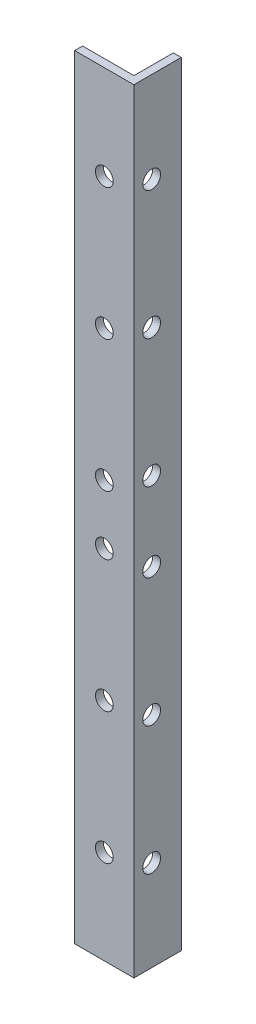
ISO-10303-21;
HEADER;
FILE_DESCRIPTION(('STEP AP214'),'2;1');
FILE_NAME('part.step','',(''),(''),'','','');
FILE_SCHEMA(('AUTOMOTIVE_DESIGN { 1 0 10303 214 1 1 1 1 }'));
ENDSEC;
DATA;
#1=APPLICATION_CONTEXT('core data for automotive mechanical design processes');
#2=APPLICATION_PROTOCOL_DEFINITION('international standard','automotive_design',2000,#1);
#3=PRODUCT_CONTEXT('',#1,'mechanical');
#4=PRODUCT('Part','Part','',(#3));
#5=PRODUCT_RELATED_PRODUCT_CATEGORY('part','',(#4));
#6=PRODUCT_DEFINITION_FORMATION('','',#4);
#7=PRODUCT_DEFINITION_CONTEXT('part definition',#1,'design');
#8=PRODUCT_DEFINITION('design','',#6,#7);
#9=PRODUCT_DEFINITION_SHAPE('','',#8);
#10=(LENGTH_UNIT() NAMED_UNIT(*) SI_UNIT(.MILLI.,.METRE.));
#11=(NAMED_UNIT(*) PLANE_ANGLE_UNIT() SI_UNIT($,.RADIAN.));
#12=(NAMED_UNIT(*) SI_UNIT($,.STERADIAN.) SOLID_ANGLE_UNIT());
#13=UNCERTAINTY_MEASURE_WITH_UNIT(LENGTH_MEASURE(1.E-05),#10,'distance_accuracy_value','');
#14=(GEOMETRIC_REPRESENTATION_CONTEXT(3) GLOBAL_UNCERTAINTY_ASSIGNED_CONTEXT((#13)) GLOBAL_UNIT_ASSIGNED_CONTEXT((#10,
#11,#12)) REPRESENTATION_CONTEXT('',''));
#15=CARTESIAN_POINT('',(0.,0.,0.));
#16=DIRECTION('',(0.,0.,1.));
#17=DIRECTION('',(1.,0.,0.));
#18=AXIS2_PLACEMENT_3D('',#15,#16,#17);
#19=CARTESIAN_POINT('',(0.,196.,-2.));
#20=DIRECTION('',(1.,0.,0.));
#21=DIRECTION('',(0.,0.,-1.));
#22=AXIS2_PLACEMENT_3D('',#19,#20,#21);
#23=PLANE('',#22);
#24=DIRECTION('',(0.,0.,1.));
#25=VECTOR('',#24,1.);
#26=CARTESIAN_POINT('',(0.,0.,-2.));
#27=LINE('',#26,#25);
#28=CARTESIAN_POINT('',(0.,0.,-2.));
#29=VERTEX_POINT('',#28);
#30=CARTESIAN_POINT('',(0.,0.,0.));
#31=VERTEX_POINT('',#30);
#32=EDGE_CURVE('E123',#29,#31,#27,.T.);
#33=ORIENTED_EDGE('',*,*,#32,.T.);
#34=DIRECTION('',(0.,-1.,0.));
#35=VECTOR('',#34,1.);
#36=CARTESIAN_POINT('',(0.,196.,0.));
#37=LINE('',#36,#35);
#38=CARTESIAN_POINT('',(0.,196.,0.));
#39=VERTEX_POINT('',#38);
#40=EDGE_CURVE('E11',#39,#31,#37,.T.);
#41=ORIENTED_EDGE('',*,*,#40,.F.);
#42=DIRECTION('',(0.,0.,1.));
#43=VECTOR('',#42,1.);
#44=CARTESIAN_POINT('',(0.,196.,-2.));
#45=LINE('',#44,#43);
#46=CARTESIAN_POINT('',(0.,196.,-2.));
#47=VERTEX_POINT('',#46);
#48=EDGE_CURVE('E134',#47,#39,#45,.T.);
#49=ORIENTED_EDGE('',*,*,#48,.F.);
#50=DIRECTION('',(0.,-1.,0.));
#51=VECTOR('',#50,1.);
#52=CARTESIAN_POINT('',(0.,196.,-2.));
#53=LINE('',#52,#51);
#54=EDGE_CURVE('E119',#47,#29,#53,.T.);
#55=ORIENTED_EDGE('',*,*,#54,.T.);
#56=EDGE_LOOP('',(#33,#41,#49,#55));
#57=FACE_BOUND('',#56,.T.);
#58=ADVANCED_FACE('F39',(#57),#23,.F.);
#59=CARTESIAN_POINT('',(0.,196.,0.));
#60=DIRECTION('',(0.,0.,-1.));
#61=DIRECTION('',(-1.,0.,0.));
#62=AXIS2_PLACEMENT_3D('',#59,#60,#61);
#63=PLANE('',#62);
#64=CARTESIAN_POINT('',(7.49999999999998,23.8333333333333,0.));
#65=DIRECTION('',(0.,0.,1.));
#66=DIRECTION('',(1.,0.,0.));
#67=AXIS2_PLACEMENT_3D('',#64,#65,#66);
#68=CIRCLE('',#67,2.24999999999999);
#69=CARTESIAN_POINT('',(9.74999999999997,23.8333333333333,0.));
#70=VERTEX_POINT('',#69);
#71=EDGE_CURVE('E421',#70,#70,#68,.T.);
#72=ORIENTED_EDGE('',*,*,#71,.F.);
#73=EDGE_LOOP('',(#72));
#74=FACE_BOUND('',#73,.T.);
#75=CARTESIAN_POINT('',(7.49999999999997,57.1666666666667,0.));
#76=DIRECTION('',(0.,0.,1.));
#77=DIRECTION('',(1.,0.,0.));
#78=AXIS2_PLACEMENT_3D('',#75,#76,#77);
#79=CIRCLE('',#78,2.24999999999999);
#80=CARTESIAN_POINT('',(9.74999999999996,57.1666666666667,0.));
#81=VERTEX_POINT('',#80);
#82=EDGE_CURVE('E429',#81,#81,#79,.T.);
#83=ORIENTED_EDGE('',*,*,#82,.F.);
#84=EDGE_LOOP('',(#83));
#85=FACE_BOUND('',#84,.T.);
#86=CARTESIAN_POINT('',(7.49999999999997,90.5,0.));
#87=DIRECTION('',(0.,0.,1.));
#88=DIRECTION('',(1.,0.,0.));
#89=AXIS2_PLACEMENT_3D('',#86,#87,#88);
#90=CIRCLE('',#89,2.25);
#91=CARTESIAN_POINT('',(9.74999999999997,90.5,0.));
#92=VERTEX_POINT('',#91);
#93=EDGE_CURVE('E435',#92,#92,#90,.T.);
#94=ORIENTED_EDGE('',*,*,#93,.F.);
#95=EDGE_LOOP('',(#94));
#96=FACE_BOUND('',#95,.T.);
#97=CARTESIAN_POINT('',(7.49999999999997,105.5,0.));
#98=DIRECTION('',(0.,0.,1.));
#99=DIRECTION('',(1.,0.,0.));
#100=AXIS2_PLACEMENT_3D('',#97,#98,#99);
#101=CIRCLE('',#100,2.25);
#102=CARTESIAN_POINT('',(9.74999999999997,105.5,0.));
#103=VERTEX_POINT('',#102);
#104=EDGE_CURVE('E441',#103,#103,#101,.T.);
#105=ORIENTED_EDGE('',*,*,#104,.F.);
#106=EDGE_LOOP('',(#105));
#107=FACE_BOUND('',#106,.T.);
#108=CARTESIAN_POINT('',(7.49999999999997,138.833333333333,0.));
#109=DIRECTION('',(0.,0.,1.));
#110=DIRECTION('',(1.,0.,0.));
#111=AXIS2_PLACEMENT_3D('',#108,#109,#110);
#112=CIRCLE('',#111,2.25);
#113=CARTESIAN_POINT('',(9.74999999999997,138.833333333333,0.));
#114=VERTEX_POINT('',#113);
#115=EDGE_CURVE('E447',#114,#114,#112,.T.);
#116=ORIENTED_EDGE('',*,*,#115,.F.);
#117=EDGE_LOOP('',(#116));
#118=FACE_BOUND('',#117,.T.);
#119=CARTESIAN_POINT('',(7.49999999999998,172.166666666667,0.));
#120=DIRECTION('',(0.,0.,1.));
#121=DIRECTION('',(1.,0.,0.));
#122=AXIS2_PLACEMENT_3D('',#119,#120,#121);
#123=CIRCLE('',#122,2.25);
#124=CARTESIAN_POINT('',(9.74999999999998,172.166666666667,0.));
#125=VERTEX_POINT('',#124);
#126=EDGE_CURVE('E453',#125,#125,#123,.T.);
#127=ORIENTED_EDGE('',*,*,#126,.F.);
#128=EDGE_LOOP('',(#127));
#129=FACE_BOUND('',#128,.T.);
#130=DIRECTION('',(1.,0.,0.));
#131=VECTOR('',#130,1.);
#132=CARTESIAN_POINT('',(0.,0.,0.));
#133=LINE('',#132,#131);
#134=CARTESIAN_POINT('',(15.,0.,0.));
#135=VERTEX_POINT('',#134);
#136=EDGE_CURVE('E126',#31,#135,#133,.T.);
#137=ORIENTED_EDGE('',*,*,#136,.T.);
#138=DIRECTION('',(0.,-1.,0.));
#139=VECTOR('',#138,1.);
#140=CARTESIAN_POINT('',(15.,196.,0.));
#141=LINE('',#140,#139);
#142=CARTESIAN_POINT('',(15.,196.,0.));
#143=VERTEX_POINT('',#142);
#144=EDGE_CURVE('E47',#143,#135,#141,.T.);
#145=ORIENTED_EDGE('',*,*,#144,.F.);
#146=DIRECTION('',(1.,0.,0.));
#147=VECTOR('',#146,1.);
#148=CARTESIAN_POINT('',(0.,196.,0.));
#149=LINE('',#148,#147);
#150=EDGE_CURVE('E92',#39,#143,#149,.T.);
#151=ORIENTED_EDGE('',*,*,#150,.F.);
#152=ORIENTED_EDGE('',*,*,#40,.T.);
#153=EDGE_LOOP('',(#137,#145,#151,#152));
#154=FACE_BOUND('',#153,.T.);
#155=ADVANCED_FACE('F162',(#74,#85,#96,#107,#118,#129,#154),#63,.F.);
#156=CARTESIAN_POINT('',(15.,196.,0.));
#157=DIRECTION('',(-1.,0.,0.));
#158=DIRECTION('',(0.,0.,1.));
#159=AXIS2_PLACEMENT_3D('',#156,#157,#158);
#160=PLANE('',#159);
#161=CARTESIAN_POINT('',(15.,23.,-4.49999999999989));
#162=DIRECTION('',(1.,0.,0.));
#163=DIRECTION('',(0.,0.,-1.));
#164=AXIS2_PLACEMENT_3D('',#161,#162,#163);
#165=CIRCLE('',#164,2.25);
#166=CARTESIAN_POINT('',(15.,23.,-6.74999999999989));
#167=VERTEX_POINT('',#166);
#168=EDGE_CURVE('E461',#167,#167,#165,.T.);
#169=ORIENTED_EDGE('',*,*,#168,.F.);
#170=EDGE_LOOP('',(#169));
#171=FACE_BOUND('',#170,.T.);
#172=CARTESIAN_POINT('',(15.,55.5,-4.49999999999992));
#173=DIRECTION('',(1.,0.,0.));
#174=DIRECTION('',(0.,0.,-1.));
#175=AXIS2_PLACEMENT_3D('',#172,#173,#174);
#176=CIRCLE('',#175,2.25);
#177=CARTESIAN_POINT('',(15.,55.5,-6.74999999999992));
#178=VERTEX_POINT('',#177);
#179=EDGE_CURVE('E464',#178,#178,#176,.T.);
#180=ORIENTED_EDGE('',*,*,#179,.F.);
#181=EDGE_LOOP('',(#180));
#182=FACE_BOUND('',#181,.T.);
#183=CARTESIAN_POINT('',(15.,88.0000000000001,-4.50000000000003));
#184=DIRECTION('',(1.,0.,0.));
#185=DIRECTION('',(0.,0.,-1.));
#186=AXIS2_PLACEMENT_3D('',#183,#184,#185);
#187=CIRCLE('',#186,2.25);
#188=CARTESIAN_POINT('',(15.,88.0000000000001,-6.75000000000003));
#189=VERTEX_POINT('',#188);
#190=EDGE_CURVE('E470',#189,#189,#187,.T.);
#191=ORIENTED_EDGE('',*,*,#190,.F.);
#192=EDGE_LOOP('',(#191));
#193=FACE_BOUND('',#192,.T.);
#194=CARTESIAN_POINT('',(15.,108.,-4.50000000000003));
#195=DIRECTION('',(1.,0.,0.));
#196=DIRECTION('',(0.,0.,-1.));
#197=AXIS2_PLACEMENT_3D('',#194,#195,#196);
#198=CIRCLE('',#197,2.25);
#199=CARTESIAN_POINT('',(15.,108.,-6.75000000000003));
#200=VERTEX_POINT('',#199);
#201=EDGE_CURVE('E476',#200,#200,#198,.T.);
#202=ORIENTED_EDGE('',*,*,#201,.F.);
#203=EDGE_LOOP('',(#202));
#204=FACE_BOUND('',#203,.T.);
#205=CARTESIAN_POINT('',(15.,140.5,-4.49999999999992));
#206=DIRECTION('',(1.,0.,0.));
#207=DIRECTION('',(0.,0.,-1.));
#208=AXIS2_PLACEMENT_3D('',#205,#206,#207);
#209=CIRCLE('',#208,2.25);
#210=CARTESIAN_POINT('',(15.,140.5,-6.74999999999992));
#211=VERTEX_POINT('',#210);
#212=EDGE_CURVE('E482',#211,#211,#209,.T.);
#213=ORIENTED_EDGE('',*,*,#212,.F.);
#214=EDGE_LOOP('',(#213));
#215=FACE_BOUND('',#214,.T.);
#216=CARTESIAN_POINT('',(15.,173.,-4.49999999999995));
#217=DIRECTION('',(1.,0.,0.));
#218=DIRECTION('',(0.,0.,-1.));
#219=AXIS2_PLACEMENT_3D('',#216,#217,#218);
#220=CIRCLE('',#219,2.25);
#221=CARTESIAN_POINT('',(15.,173.,-6.74999999999995));
#222=VERTEX_POINT('',#221);
#223=EDGE_CURVE('E427',#222,#222,#220,.T.);
#224=ORIENTED_EDGE('',*,*,#223,.F.);
#225=EDGE_LOOP('',(#224));
#226=FACE_BOUND('',#225,.T.);
#227=DIRECTION('',(0.,0.,-1.));
#228=VECTOR('',#227,1.);
#229=CARTESIAN_POINT('',(15.,0.,0.));
#230=LINE('',#229,#228);
#231=CARTESIAN_POINT('',(15.,0.,-12.));
#232=VERTEX_POINT('',#231);
#233=EDGE_CURVE('E129',#135,#232,#230,.T.);
#234=ORIENTED_EDGE('',*,*,#233,.T.);
#235=DIRECTION('',(0.,-1.,0.));
#236=VECTOR('',#235,1.);
#237=CARTESIAN_POINT('',(15.,196.,-12.));
#238=LINE('',#237,#236);
#239=CARTESIAN_POINT('',(15.,196.,-12.));
#240=VERTEX_POINT('',#239);
#241=EDGE_CURVE('E114',#240,#232,#238,.T.);
#242=ORIENTED_EDGE('',*,*,#241,.F.);
#243=DIRECTION('',(0.,0.,-1.));
#244=VECTOR('',#243,1.);
#245=CARTESIAN_POINT('',(15.,196.,0.));
#246=LINE('',#245,#244);
#247=EDGE_CURVE('E105',#143,#240,#246,.T.);
#248=ORIENTED_EDGE('',*,*,#247,.F.);
#249=ORIENTED_EDGE('',*,*,#144,.T.);
#250=EDGE_LOOP('',(#234,#242,#248,#249));
#251=FACE_BOUND('',#250,.T.);
#252=ADVANCED_FACE('F140',(#171,#182,#193,#204,#215,#226,#251),#160,.F.);
#253=CARTESIAN_POINT('',(15.,196.,-12.));
#254=DIRECTION('',(0.,0.,1.));
#255=DIRECTION('',(1.,0.,0.));
#256=AXIS2_PLACEMENT_3D('',#253,#254,#255);
#257=PLANE('',#256);
#258=DIRECTION('',(-1.,0.,0.));
#259=VECTOR('',#258,1.);
#260=CARTESIAN_POINT('',(15.,0.,-12.));
#261=LINE('',#260,#259);
#262=CARTESIAN_POINT('',(13.,0.,-12.));
#263=VERTEX_POINT('',#262);
#264=EDGE_CURVE('E113',#232,#263,#261,.T.);
#265=ORIENTED_EDGE('',*,*,#264,.T.);
#266=DIRECTION('',(0.,-1.,0.));
#267=VECTOR('',#266,1.);
#268=CARTESIAN_POINT('',(13.,196.,-12.));
#269=LINE('',#268,#267);
#270=CARTESIAN_POINT('',(13.,196.,-12.));
#271=VERTEX_POINT('',#270);
#272=EDGE_CURVE('E110',#271,#263,#269,.T.);
#273=ORIENTED_EDGE('',*,*,#272,.F.);
#274=DIRECTION('',(-1.,0.,0.));
#275=VECTOR('',#274,1.);
#276=CARTESIAN_POINT('',(15.,196.,-12.));
#277=LINE('',#276,#275);
#278=EDGE_CURVE('E99',#240,#271,#277,.T.);
#279=ORIENTED_EDGE('',*,*,#278,.F.);
#280=ORIENTED_EDGE('',*,*,#241,.T.);
#281=EDGE_LOOP('',(#265,#273,#279,#280));
#282=FACE_BOUND('',#281,.T.);
#283=ADVANCED_FACE('F111',(#282),#257,.F.);
#284=CARTESIAN_POINT('',(13.,196.,-12.));
#285=DIRECTION('',(1.,0.,0.));
#286=DIRECTION('',(0.,0.,-1.));
#287=AXIS2_PLACEMENT_3D('',#284,#285,#286);
#288=PLANE('',#287);
#289=CARTESIAN_POINT('',(13.,23.,-4.49999999999989));
#290=DIRECTION('',(1.,0.,0.));
#291=DIRECTION('',(0.,0.,-1.));
#292=AXIS2_PLACEMENT_3D('',#289,#290,#291);
#293=CIRCLE('',#292,2.25);
#294=CARTESIAN_POINT('',(13.,23.,-6.7499999999999));
#295=VERTEX_POINT('',#294);
#296=EDGE_CURVE('E127',#295,#295,#293,.F.);
#297=ORIENTED_EDGE('',*,*,#296,.F.);
#298=EDGE_LOOP('',(#297));
#299=FACE_BOUND('',#298,.T.);
#300=CARTESIAN_POINT('',(13.,55.5,-4.49999999999992));
#301=DIRECTION('',(1.,0.,0.));
#302=DIRECTION('',(0.,0.,-1.));
#303=AXIS2_PLACEMENT_3D('',#300,#301,#302);
#304=CIRCLE('',#303,2.25);
#305=CARTESIAN_POINT('',(13.,55.5,-6.74999999999992));
#306=VERTEX_POINT('',#305);
#307=EDGE_CURVE('E467',#306,#306,#304,.F.);
#308=ORIENTED_EDGE('',*,*,#307,.F.);
#309=EDGE_LOOP('',(#308));
#310=FACE_BOUND('',#309,.T.);
#311=CARTESIAN_POINT('',(13.,88.0000000000001,-4.50000000000003));
#312=DIRECTION('',(1.,0.,0.));
#313=DIRECTION('',(0.,0.,-1.));
#314=AXIS2_PLACEMENT_3D('',#311,#312,#313);
#315=CIRCLE('',#314,2.25);
#316=CARTESIAN_POINT('',(13.,88.0000000000001,-6.75000000000003));
#317=VERTEX_POINT('',#316);
#318=EDGE_CURVE('E473',#317,#317,#315,.F.);
#319=ORIENTED_EDGE('',*,*,#318,.F.);
#320=EDGE_LOOP('',(#319));
#321=FACE_BOUND('',#320,.T.);
#322=CARTESIAN_POINT('',(13.,108.,-4.50000000000003));
#323=DIRECTION('',(1.,0.,0.));
#324=DIRECTION('',(0.,0.,-1.));
#325=AXIS2_PLACEMENT_3D('',#322,#323,#324);
#326=CIRCLE('',#325,2.25);
#327=CARTESIAN_POINT('',(13.,108.,-6.75000000000004));
#328=VERTEX_POINT('',#327);
#329=EDGE_CURVE('E479',#328,#328,#326,.F.);
#330=ORIENTED_EDGE('',*,*,#329,.F.);
#331=EDGE_LOOP('',(#330));
#332=FACE_BOUND('',#331,.T.);
#333=CARTESIAN_POINT('',(13.,140.5,-4.49999999999992));
#334=DIRECTION('',(1.,0.,0.));
#335=DIRECTION('',(0.,0.,-1.));
#336=AXIS2_PLACEMENT_3D('',#333,#334,#335);
#337=CIRCLE('',#336,2.25);
#338=CARTESIAN_POINT('',(13.,140.5,-6.74999999999992));
#339=VERTEX_POINT('',#338);
#340=EDGE_CURVE('E485',#339,#339,#337,.F.);
#341=ORIENTED_EDGE('',*,*,#340,.F.);
#342=EDGE_LOOP('',(#341));
#343=FACE_BOUND('',#342,.T.);
#344=CARTESIAN_POINT('',(13.,173.,-4.49999999999995));
#345=DIRECTION('',(1.,0.,0.));
#346=DIRECTION('',(0.,0.,-1.));
#347=AXIS2_PLACEMENT_3D('',#344,#345,#346);
#348=CIRCLE('',#347,2.25);
#349=CARTESIAN_POINT('',(13.,173.,-6.74999999999995));
#350=VERTEX_POINT('',#349);
#351=EDGE_CURVE('E424',#350,#350,#348,.F.);
#352=ORIENTED_EDGE('',*,*,#351,.F.);
#353=EDGE_LOOP('',(#352));
#354=FACE_BOUND('',#353,.T.);
#355=DIRECTION('',(0.,0.,1.));
#356=VECTOR('',#355,1.);
#357=CARTESIAN_POINT('',(13.,0.,-12.));
#358=LINE('',#357,#356);
#359=CARTESIAN_POINT('',(13.,0.,-2.));
#360=VERTEX_POINT('',#359);
#361=EDGE_CURVE('E78',#263,#360,#358,.T.);
#362=ORIENTED_EDGE('',*,*,#361,.T.);
#363=DIRECTION('',(0.,-1.,0.));
#364=VECTOR('',#363,1.);
#365=CARTESIAN_POINT('',(13.,196.,-2.));
#366=LINE('',#365,#364);
#367=CARTESIAN_POINT('',(13.,196.,-2.));
#368=VERTEX_POINT('',#367);
#369=EDGE_CURVE('E115',#368,#360,#366,.T.);
#370=ORIENTED_EDGE('',*,*,#369,.F.);
#371=DIRECTION('',(0.,0.,1.));
#372=VECTOR('',#371,1.);
#373=CARTESIAN_POINT('',(13.,196.,-12.));
#374=LINE('',#373,#372);
#375=EDGE_CURVE('E103',#271,#368,#374,.T.);
#376=ORIENTED_EDGE('',*,*,#375,.F.);
#377=ORIENTED_EDGE('',*,*,#272,.T.);
#378=EDGE_LOOP('',(#362,#370,#376,#377));
#379=FACE_BOUND('',#378,.T.);
#380=ADVANCED_FACE('F117',(#299,#310,#321,#332,#343,#354,#379),#288,.F.);
#381=CARTESIAN_POINT('',(13.,196.,-2.));
#382=DIRECTION('',(0.,0.,1.));
#383=DIRECTION('',(1.,0.,0.));
#384=AXIS2_PLACEMENT_3D('',#381,#382,#383);
#385=PLANE('',#384);
#386=CARTESIAN_POINT('',(7.49999999999998,23.8333333333333,-2.));
#387=DIRECTION('',(0.,0.,1.));
#388=DIRECTION('',(1.,0.,0.));
#389=AXIS2_PLACEMENT_3D('',#386,#387,#388);
#390=CIRCLE('',#389,2.24999999999999);
#391=CARTESIAN_POINT('',(9.74999999999997,23.8333333333333,-2.));
#392=VERTEX_POINT('',#391);
#393=EDGE_CURVE('E423',#392,#392,#390,.F.);
#394=ORIENTED_EDGE('',*,*,#393,.F.);
#395=EDGE_LOOP('',(#394));
#396=FACE_BOUND('',#395,.T.);
#397=CARTESIAN_POINT('',(7.49999999999997,57.1666666666667,-2.));
#398=DIRECTION('',(0.,0.,1.));
#399=DIRECTION('',(1.,0.,0.));
#400=AXIS2_PLACEMENT_3D('',#397,#398,#399);
#401=CIRCLE('',#400,2.24999999999999);
#402=CARTESIAN_POINT('',(9.74999999999996,57.1666666666667,-2.));
#403=VERTEX_POINT('',#402);
#404=EDGE_CURVE('E432',#403,#403,#401,.F.);
#405=ORIENTED_EDGE('',*,*,#404,.F.);
#406=EDGE_LOOP('',(#405));
#407=FACE_BOUND('',#406,.T.);
#408=CARTESIAN_POINT('',(7.49999999999997,90.5,-2.));
#409=DIRECTION('',(0.,0.,1.));
#410=DIRECTION('',(1.,0.,0.));
#411=AXIS2_PLACEMENT_3D('',#408,#409,#410);
#412=CIRCLE('',#411,2.25);
#413=CARTESIAN_POINT('',(9.74999999999997,90.5,-2.));
#414=VERTEX_POINT('',#413);
#415=EDGE_CURVE('E438',#414,#414,#412,.F.);
#416=ORIENTED_EDGE('',*,*,#415,.F.);
#417=EDGE_LOOP('',(#416));
#418=FACE_BOUND('',#417,.T.);
#419=CARTESIAN_POINT('',(7.49999999999997,105.5,-2.));
#420=DIRECTION('',(0.,0.,1.));
#421=DIRECTION('',(1.,0.,0.));
#422=AXIS2_PLACEMENT_3D('',#419,#420,#421);
#423=CIRCLE('',#422,2.25);
#424=CARTESIAN_POINT('',(9.74999999999997,105.5,-2.));
#425=VERTEX_POINT('',#424);
#426=EDGE_CURVE('E444',#425,#425,#423,.F.);
#427=ORIENTED_EDGE('',*,*,#426,.F.);
#428=EDGE_LOOP('',(#427));
#429=FACE_BOUND('',#428,.T.);
#430=CARTESIAN_POINT('',(7.49999999999997,138.833333333333,-2.));
#431=DIRECTION('',(0.,0.,1.));
#432=DIRECTION('',(1.,0.,0.));
#433=AXIS2_PLACEMENT_3D('',#430,#431,#432);
#434=CIRCLE('',#433,2.25);
#435=CARTESIAN_POINT('',(9.74999999999997,138.833333333333,-2.));
#436=VERTEX_POINT('',#435);
#437=EDGE_CURVE('E450',#436,#436,#434,.F.);
#438=ORIENTED_EDGE('',*,*,#437,.F.);
#439=EDGE_LOOP('',(#438));
#440=FACE_BOUND('',#439,.T.);
#441=CARTESIAN_POINT('',(7.49999999999998,172.166666666667,-2.));
#442=DIRECTION('',(0.,0.,1.));
#443=DIRECTION('',(1.,0.,0.));
#444=AXIS2_PLACEMENT_3D('',#441,#442,#443);
#445=CIRCLE('',#444,2.25);
#446=CARTESIAN_POINT('',(9.74999999999998,172.166666666667,-2.));
#447=VERTEX_POINT('',#446);
#448=EDGE_CURVE('E456',#447,#447,#445,.F.);
#449=ORIENTED_EDGE('',*,*,#448,.F.);
#450=EDGE_LOOP('',(#449));
#451=FACE_BOUND('',#450,.T.);
#452=DIRECTION('',(-1.,0.,0.));
#453=VECTOR('',#452,1.);
#454=CARTESIAN_POINT('',(13.,0.,-2.));
#455=LINE('',#454,#453);
#456=EDGE_CURVE('E84',#360,#29,#455,.T.);
#457=ORIENTED_EDGE('',*,*,#456,.T.);
#458=ORIENTED_EDGE('',*,*,#54,.F.);
#459=DIRECTION('',(-1.,0.,0.));
#460=VECTOR('',#459,1.);
#461=CARTESIAN_POINT('',(13.,196.,-2.));
#462=LINE('',#461,#460);
#463=EDGE_CURVE('E55',#368,#47,#462,.T.);
#464=ORIENTED_EDGE('',*,*,#463,.F.);
#465=ORIENTED_EDGE('',*,*,#369,.T.);
#466=EDGE_LOOP('',(#457,#458,#464,#465));
#467=FACE_BOUND('',#466,.T.);
#468=ADVANCED_FACE('F147',(#396,#407,#418,#429,#440,#451,#467),#385,.F.);
#469=CARTESIAN_POINT('',(0.,196.,0.));
#470=DIRECTION('',(0.,1.,0.));
#471=DIRECTION('',(0.,0.,1.));
#472=AXIS2_PLACEMENT_3D('',#469,#470,#471);
#473=PLANE('',#472);
#474=ORIENTED_EDGE('',*,*,#48,.T.);
#475=ORIENTED_EDGE('',*,*,#150,.T.);
#476=ORIENTED_EDGE('',*,*,#247,.T.);
#477=ORIENTED_EDGE('',*,*,#278,.T.);
#478=ORIENTED_EDGE('',*,*,#375,.T.);
#479=ORIENTED_EDGE('',*,*,#463,.T.);
#480=EDGE_LOOP('',(#474,#475,#476,#477,#478,#479));
#481=FACE_BOUND('',#480,.T.);
#482=ADVANCED_FACE('F101',(#481),#473,.T.);
#483=CARTESIAN_POINT('',(0.,0.,0.));
#484=DIRECTION('',(0.,1.,0.));
#485=DIRECTION('',(0.,0.,1.));
#486=AXIS2_PLACEMENT_3D('',#483,#484,#485);
#487=PLANE('',#486);
#488=ORIENTED_EDGE('',*,*,#32,.F.);
#489=ORIENTED_EDGE('',*,*,#456,.F.);
#490=ORIENTED_EDGE('',*,*,#361,.F.);
#491=ORIENTED_EDGE('',*,*,#264,.F.);
#492=ORIENTED_EDGE('',*,*,#233,.F.);
#493=ORIENTED_EDGE('',*,*,#136,.F.);
#494=EDGE_LOOP('',(#488,#489,#490,#491,#492,#493));
#495=FACE_BOUND('',#494,.T.);
#496=ADVANCED_FACE('F143',(#495),#487,.F.);
#497=CARTESIAN_POINT('',(-0.001000000000001,173.,-4.49999999999995));
#498=DIRECTION('',(1.,0.,0.));
#499=DIRECTION('',(0.,0.,-1.));
#500=AXIS2_PLACEMENT_3D('',#497,#498,#499);
#501=CYLINDRICAL_SURFACE('',#500,2.25);
#502=ORIENTED_EDGE('',*,*,#223,.T.);
#503=EDGE_LOOP('',(#502));
#504=FACE_BOUND('',#503,.T.);
#505=ORIENTED_EDGE('',*,*,#351,.T.);
#506=EDGE_LOOP('',(#505));
#507=FACE_BOUND('',#506,.T.);
#508=ADVANCED_FACE('F207',(#504,#507),#501,.F.);
#509=CARTESIAN_POINT('',(-0.001000000000001,140.5,-4.49999999999992));
#510=DIRECTION('',(1.,0.,0.));
#511=DIRECTION('',(0.,0.,-1.));
#512=AXIS2_PLACEMENT_3D('',#509,#510,#511);
#513=CYLINDRICAL_SURFACE('',#512,2.25);
#514=ORIENTED_EDGE('',*,*,#212,.T.);
#515=EDGE_LOOP('',(#514));
#516=FACE_BOUND('',#515,.T.);
#517=ORIENTED_EDGE('',*,*,#340,.T.);
#518=EDGE_LOOP('',(#517));
#519=FACE_BOUND('',#518,.T.);
#520=ADVANCED_FACE('F214',(#516,#519),#513,.F.);
#521=CARTESIAN_POINT('',(-0.001000000000001,108.,-4.50000000000003));
#522=DIRECTION('',(1.,0.,0.));
#523=DIRECTION('',(0.,0.,-1.));
#524=AXIS2_PLACEMENT_3D('',#521,#522,#523);
#525=CYLINDRICAL_SURFACE('',#524,2.25);
#526=ORIENTED_EDGE('',*,*,#201,.T.);
#527=EDGE_LOOP('',(#526));
#528=FACE_BOUND('',#527,.T.);
#529=ORIENTED_EDGE('',*,*,#329,.T.);
#530=EDGE_LOOP('',(#529));
#531=FACE_BOUND('',#530,.T.);
#532=ADVANCED_FACE('F224',(#528,#531),#525,.F.);
#533=CARTESIAN_POINT('',(-0.001000000000001,88.0000000000001,-4.50000000000003));
#534=DIRECTION('',(1.,0.,0.));
#535=DIRECTION('',(0.,0.,-1.));
#536=AXIS2_PLACEMENT_3D('',#533,#534,#535);
#537=CYLINDRICAL_SURFACE('',#536,2.25);
#538=ORIENTED_EDGE('',*,*,#190,.T.);
#539=EDGE_LOOP('',(#538));
#540=FACE_BOUND('',#539,.T.);
#541=ORIENTED_EDGE('',*,*,#318,.T.);
#542=EDGE_LOOP('',(#541));
#543=FACE_BOUND('',#542,.T.);
#544=ADVANCED_FACE('F234',(#540,#543),#537,.F.);
#545=CARTESIAN_POINT('',(-0.001000000000001,55.5,-4.49999999999992));
#546=DIRECTION('',(1.,0.,0.));
#547=DIRECTION('',(0.,0.,-1.));
#548=AXIS2_PLACEMENT_3D('',#545,#546,#547);
#549=CYLINDRICAL_SURFACE('',#548,2.25);
#550=ORIENTED_EDGE('',*,*,#179,.T.);
#551=EDGE_LOOP('',(#550));
#552=FACE_BOUND('',#551,.T.);
#553=ORIENTED_EDGE('',*,*,#307,.T.);
#554=EDGE_LOOP('',(#553));
#555=FACE_BOUND('',#554,.T.);
#556=ADVANCED_FACE('F244',(#552,#555),#549,.F.);
#557=CARTESIAN_POINT('',(-0.001000000000001,23.,-4.49999999999989));
#558=DIRECTION('',(1.,0.,0.));
#559=DIRECTION('',(0.,0.,-1.));
#560=AXIS2_PLACEMENT_3D('',#557,#558,#559);
#561=CYLINDRICAL_SURFACE('',#560,2.25);
#562=ORIENTED_EDGE('',*,*,#168,.T.);
#563=EDGE_LOOP('',(#562));
#564=FACE_BOUND('',#563,.T.);
#565=ORIENTED_EDGE('',*,*,#296,.T.);
#566=EDGE_LOOP('',(#565));
#567=FACE_BOUND('',#566,.T.);
#568=ADVANCED_FACE('F254',(#564,#567),#561,.F.);
#569=CARTESIAN_POINT('',(7.49999999999998,172.166666666667,-12.001));
#570=DIRECTION('',(0.,0.,1.));
#571=DIRECTION('',(1.,0.,0.));
#572=AXIS2_PLACEMENT_3D('',#569,#570,#571);
#573=CYLINDRICAL_SURFACE('',#572,2.25);
#574=ORIENTED_EDGE('',*,*,#126,.T.);
#575=EDGE_LOOP('',(#574));
#576=FACE_BOUND('',#575,.T.);
#577=ORIENTED_EDGE('',*,*,#448,.T.);
#578=EDGE_LOOP('',(#577));
#579=FACE_BOUND('',#578,.T.);
#580=ADVANCED_FACE('F264',(#576,#579),#573,.F.);
#581=CARTESIAN_POINT('',(7.49999999999997,138.833333333333,-12.001));
#582=DIRECTION('',(0.,0.,1.));
#583=DIRECTION('',(1.,0.,0.));
#584=AXIS2_PLACEMENT_3D('',#581,#582,#583);
#585=CYLINDRICAL_SURFACE('',#584,2.25);
#586=ORIENTED_EDGE('',*,*,#115,.T.);
#587=EDGE_LOOP('',(#586));
#588=FACE_BOUND('',#587,.T.);
#589=ORIENTED_EDGE('',*,*,#437,.T.);
#590=EDGE_LOOP('',(#589));
#591=FACE_BOUND('',#590,.T.);
#592=ADVANCED_FACE('F273',(#588,#591),#585,.F.);
#593=CARTESIAN_POINT('',(7.49999999999997,105.5,-12.001));
#594=DIRECTION('',(0.,0.,1.));
#595=DIRECTION('',(1.,0.,0.));
#596=AXIS2_PLACEMENT_3D('',#593,#594,#595);
#597=CYLINDRICAL_SURFACE('',#596,2.25);
#598=ORIENTED_EDGE('',*,*,#104,.T.);
#599=EDGE_LOOP('',(#598));
#600=FACE_BOUND('',#599,.T.);
#601=ORIENTED_EDGE('',*,*,#426,.T.);
#602=EDGE_LOOP('',(#601));
#603=FACE_BOUND('',#602,.T.);
#604=ADVANCED_FACE('F283',(#600,#603),#597,.F.);
#605=CARTESIAN_POINT('',(7.49999999999997,90.5,-12.001));
#606=DIRECTION('',(0.,0.,1.));
#607=DIRECTION('',(1.,0.,0.));
#608=AXIS2_PLACEMENT_3D('',#605,#606,#607);
#609=CYLINDRICAL_SURFACE('',#608,2.25);
#610=ORIENTED_EDGE('',*,*,#93,.T.);
#611=EDGE_LOOP('',(#610));
#612=FACE_BOUND('',#611,.T.);
#613=ORIENTED_EDGE('',*,*,#415,.T.);
#614=EDGE_LOOP('',(#613));
#615=FACE_BOUND('',#614,.T.);
#616=ADVANCED_FACE('F293',(#612,#615),#609,.F.);
#617=CARTESIAN_POINT('',(7.49999999999997,57.1666666666667,-12.001));
#618=DIRECTION('',(0.,0.,1.));
#619=DIRECTION('',(1.,0.,0.));
#620=AXIS2_PLACEMENT_3D('',#617,#618,#619);
#621=CYLINDRICAL_SURFACE('',#620,2.24999999999999);
#622=ORIENTED_EDGE('',*,*,#82,.T.);
#623=EDGE_LOOP('',(#622));
#624=FACE_BOUND('',#623,.T.);
#625=ORIENTED_EDGE('',*,*,#404,.T.);
#626=EDGE_LOOP('',(#625));
#627=FACE_BOUND('',#626,.T.);
#628=ADVANCED_FACE('F303',(#624,#627),#621,.F.);
#629=CARTESIAN_POINT('',(7.49999999999998,23.8333333333333,-12.001));
#630=DIRECTION('',(0.,0.,1.));
#631=DIRECTION('',(1.,0.,0.));
#632=AXIS2_PLACEMENT_3D('',#629,#630,#631);
#633=CYLINDRICAL_SURFACE('',#632,2.24999999999999);
#634=ORIENTED_EDGE('',*,*,#71,.T.);
#635=EDGE_LOOP('',(#634));
#636=FACE_BOUND('',#635,.T.);
#637=ORIENTED_EDGE('',*,*,#393,.T.);
#638=EDGE_LOOP('',(#637));
#639=FACE_BOUND('',#638,.T.);
#640=ADVANCED_FACE('F313',(#636,#639),#633,.F.);
#641=CLOSED_SHELL('',(#58,#155,#252,#283,#380,#468,#482,#496,#508,#520,#532,#544,#556,#568,#580,
#592,#604,#616,#628,#640));
#642=MANIFOLD_SOLID_BREP('B2',#641);
#643=ADVANCED_BREP_SHAPE_REPRESENTATION('',(#18,#642),#14);
#644=SHAPE_DEFINITION_REPRESENTATION(#9,#643);
ENDSEC;
END-ISO-10303-21;
